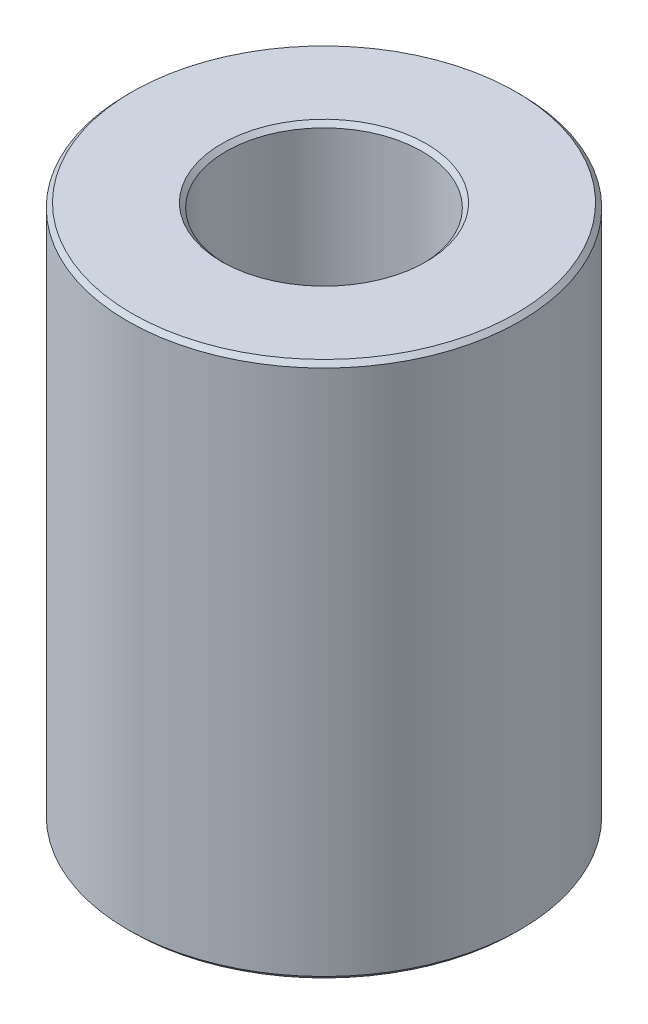
ISO-10303-21;
HEADER;
FILE_DESCRIPTION(('STEP AP214'),'2;1');
FILE_NAME('part.step','',(''),(''),'','','');
FILE_SCHEMA(('AUTOMOTIVE_DESIGN { 1 0 10303 214 1 1 1 1 }'));
ENDSEC;
DATA;
#1=APPLICATION_CONTEXT('core data for automotive mechanical design processes');
#2=APPLICATION_PROTOCOL_DEFINITION('international standard','automotive_design',2000,#1);
#3=PRODUCT_CONTEXT('',#1,'mechanical');
#4=PRODUCT('Part','Part','',(#3));
#5=PRODUCT_RELATED_PRODUCT_CATEGORY('part','',(#4));
#6=PRODUCT_DEFINITION_FORMATION('','',#4);
#7=PRODUCT_DEFINITION_CONTEXT('part definition',#1,'design');
#8=PRODUCT_DEFINITION('design','',#6,#7);
#9=PRODUCT_DEFINITION_SHAPE('','',#8);
#10=(LENGTH_UNIT() NAMED_UNIT(*) SI_UNIT(.MILLI.,.METRE.));
#11=(NAMED_UNIT(*) PLANE_ANGLE_UNIT() SI_UNIT($,.RADIAN.));
#12=(NAMED_UNIT(*) SI_UNIT($,.STERADIAN.) SOLID_ANGLE_UNIT());
#13=UNCERTAINTY_MEASURE_WITH_UNIT(LENGTH_MEASURE(1.E-05),#10,'distance_accuracy_value','');
#14=(GEOMETRIC_REPRESENTATION_CONTEXT(3) GLOBAL_UNCERTAINTY_ASSIGNED_CONTEXT((#13)) GLOBAL_UNIT_ASSIGNED_CONTEXT((#10,
#11,#12)) REPRESENTATION_CONTEXT('',''));
#15=CARTESIAN_POINT('',(0.,0.,0.));
#16=DIRECTION('',(0.,0.,1.));
#17=DIRECTION('',(1.,0.,0.));
#18=AXIS2_PLACEMENT_3D('',#15,#16,#17);
#19=CARTESIAN_POINT('',(0.,95.4662310760009,0.));
#20=DIRECTION('',(0.,-1.,0.));
#21=DIRECTION('',(0.,0.,-1.));
#22=AXIS2_PLACEMENT_3D('',#19,#20,#21);
#23=CYLINDRICAL_SURFACE('',#22,35.);
#24=CARTESIAN_POINT('',(0.,0.7812923201891,0.));
#25=DIRECTION('',(0.,1.,0.));
#26=DIRECTION('',(0.,0.,1.));
#27=AXIS2_PLACEMENT_3D('',#24,#25,#26);
#28=CIRCLE('',#27,35.);
#29=CARTESIAN_POINT('',(0.,0.7812923201891,35.));
#30=VERTEX_POINT('',#29);
#31=EDGE_CURVE('E10',#30,#30,#28,.T.);
#32=ORIENTED_EDGE('',*,*,#31,.T.);
#33=EDGE_LOOP('',(#32));
#34=FACE_BOUND('',#33,.T.);
#35=CARTESIAN_POINT('',(0.,94.6849387558118,0.));
#36=DIRECTION('',(0.,1.,0.));
#37=DIRECTION('',(0.,0.,1.));
#38=AXIS2_PLACEMENT_3D('',#35,#36,#37);
#39=CIRCLE('',#38,35.);
#40=CARTESIAN_POINT('',(0.,94.6849387558118,35.));
#41=VERTEX_POINT('',#40);
#42=EDGE_CURVE('E50',#41,#41,#39,.F.);
#43=ORIENTED_EDGE('',*,*,#42,.T.);
#44=EDGE_LOOP('',(#43));
#45=FACE_BOUND('',#44,.T.);
#46=ADVANCED_FACE('F39',(#34,#45),#23,.T.);
#47=CARTESIAN_POINT('',(0.,95.4662310760009,0.));
#48=DIRECTION('',(0.,1.,0.));
#49=DIRECTION('',(0.,0.,1.));
#50=AXIS2_PLACEMENT_3D('',#47,#48,#49);
#51=PLANE('',#50);
#52=CARTESIAN_POINT('',(0.,95.4662310760009,0.));
#53=DIRECTION('',(0.,1.,0.));
#54=DIRECTION('',(0.,0.,1.));
#55=AXIS2_PLACEMENT_3D('',#52,#53,#54);
#56=CIRCLE('',#55,18.2259943685112);
#57=CARTESIAN_POINT('',(0.,95.4662310760009,18.2259943685112));
#58=VERTEX_POINT('',#57);
#59=EDGE_CURVE('E58',#58,#58,#56,.F.);
#60=ORIENTED_EDGE('',*,*,#59,.T.);
#61=EDGE_LOOP('',(#60));
#62=FACE_BOUND('',#61,.T.);
#63=CARTESIAN_POINT('',(0.,95.4662310760009,0.));
#64=DIRECTION('',(0.,1.,0.));
#65=DIRECTION('',(0.,0.,1.));
#66=AXIS2_PLACEMENT_3D('',#63,#64,#65);
#67=CIRCLE('',#66,34.2187076798109);
#68=CARTESIAN_POINT('',(0.,95.4662310760009,34.2187076798109));
#69=VERTEX_POINT('',#68);
#70=EDGE_CURVE('E61',#69,#69,#67,.T.);
#71=ORIENTED_EDGE('',*,*,#70,.T.);
#72=EDGE_LOOP('',(#71));
#73=FACE_BOUND('',#72,.T.);
#74=ADVANCED_FACE('F88',(#62,#73),#51,.T.);
#75=CARTESIAN_POINT('',(0.,0.,0.));
#76=DIRECTION('',(0.,1.,0.));
#77=DIRECTION('',(0.,0.,1.));
#78=AXIS2_PLACEMENT_3D('',#75,#76,#77);
#79=PLANE('',#78);
#80=CARTESIAN_POINT('',(0.,0.,0.));
#81=DIRECTION('',(0.,1.,0.));
#82=DIRECTION('',(0.,0.,1.));
#83=AXIS2_PLACEMENT_3D('',#80,#81,#82);
#84=CIRCLE('',#83,18.2259943685112);
#85=CARTESIAN_POINT('',(0.,0.,18.2259943685112));
#86=VERTEX_POINT('',#85);
#87=EDGE_CURVE('E51',#86,#86,#84,.T.);
#88=ORIENTED_EDGE('',*,*,#87,.T.);
#89=EDGE_LOOP('',(#88));
#90=FACE_BOUND('',#89,.T.);
#91=CARTESIAN_POINT('',(0.,0.,0.));
#92=DIRECTION('',(0.,1.,0.));
#93=DIRECTION('',(0.,0.,1.));
#94=AXIS2_PLACEMENT_3D('',#91,#92,#93);
#95=CIRCLE('',#94,34.2187076798109);
#96=CARTESIAN_POINT('',(0.,0.,34.2187076798109));
#97=VERTEX_POINT('',#96);
#98=EDGE_CURVE('E54',#97,#97,#95,.F.);
#99=ORIENTED_EDGE('',*,*,#98,.T.);
#100=EDGE_LOOP('',(#99));
#101=FACE_BOUND('',#100,.T.);
#102=ADVANCED_FACE('F83',(#90,#101),#79,.F.);
#103=CARTESIAN_POINT('',(0.,95.4662310760009,0.));
#104=DIRECTION('',(0.,-1.,0.));
#105=DIRECTION('',(0.,0.,-1.));
#106=AXIS2_PLACEMENT_3D('',#103,#104,#105);
#107=CYLINDRICAL_SURFACE('',#106,17.4447020483221);
#108=CARTESIAN_POINT('',(0.,94.6849387558118,0.));
#109=DIRECTION('',(0.,1.,0.));
#110=DIRECTION('',(0.,0.,1.));
#111=AXIS2_PLACEMENT_3D('',#108,#109,#110);
#112=CIRCLE('',#111,17.4447020483221);
#113=CARTESIAN_POINT('',(0.,94.6849387558118,17.4447020483221));
#114=VERTEX_POINT('',#113);
#115=EDGE_CURVE('E67',#114,#114,#112,.T.);
#116=ORIENTED_EDGE('',*,*,#115,.T.);
#117=EDGE_LOOP('',(#116));
#118=FACE_BOUND('',#117,.T.);
#119=CARTESIAN_POINT('',(0.,0.781292320189086,0.));
#120=DIRECTION('',(0.,1.,0.));
#121=DIRECTION('',(0.,0.,1.));
#122=AXIS2_PLACEMENT_3D('',#119,#120,#121);
#123=CIRCLE('',#122,17.4447020483221);
#124=CARTESIAN_POINT('',(0.,0.781292320189086,17.4447020483221));
#125=VERTEX_POINT('',#124);
#126=EDGE_CURVE('E69',#125,#125,#123,.F.);
#127=ORIENTED_EDGE('',*,*,#126,.T.);
#128=EDGE_LOOP('',(#127));
#129=FACE_BOUND('',#128,.T.);
#130=ADVANCED_FACE('F71',(#118,#129),#107,.F.);
#131=CARTESIAN_POINT('',(0.,94.6849387558118,0.));
#132=DIRECTION('',(0.,1.,0.));
#133=DIRECTION('',(0.,0.,1.));
#134=AXIS2_PLACEMENT_3D('',#131,#132,#133);
#135=CONICAL_SURFACE('',#134,17.4447020483221,0.785398163397446);
#136=ORIENTED_EDGE('',*,*,#59,.F.);
#137=EDGE_LOOP('',(#136));
#138=FACE_BOUND('',#137,.T.);
#139=ORIENTED_EDGE('',*,*,#115,.F.);
#140=EDGE_LOOP('',(#139));
#141=FACE_BOUND('',#140,.T.);
#142=ADVANCED_FACE('F77',(#138,#141),#135,.F.);
#143=CARTESIAN_POINT('',(0.,0.,0.));
#144=DIRECTION('',(0.,-1.,0.));
#145=DIRECTION('',(0.,0.,-1.));
#146=AXIS2_PLACEMENT_3D('',#143,#144,#145);
#147=CONICAL_SURFACE('',#146,18.2259943685112,0.785398163397446);
#148=ORIENTED_EDGE('',*,*,#126,.F.);
#149=EDGE_LOOP('',(#148));
#150=FACE_BOUND('',#149,.T.);
#151=ORIENTED_EDGE('',*,*,#87,.F.);
#152=EDGE_LOOP('',(#151));
#153=FACE_BOUND('',#152,.T.);
#154=ADVANCED_FACE('F73',(#150,#153),#147,.F.);
#155=CARTESIAN_POINT('',(0.,0.7812923201891,0.));
#156=DIRECTION('',(0.,1.,0.));
#157=DIRECTION('',(0.,0.,1.));
#158=AXIS2_PLACEMENT_3D('',#155,#156,#157);
#159=CONICAL_SURFACE('',#158,35.,0.785398163397444);
#160=ORIENTED_EDGE('',*,*,#98,.F.);
#161=EDGE_LOOP('',(#160));
#162=FACE_BOUND('',#161,.T.);
#163=ORIENTED_EDGE('',*,*,#31,.F.);
#164=EDGE_LOOP('',(#163));
#165=FACE_BOUND('',#164,.T.);
#166=ADVANCED_FACE('F76',(#162,#165),#159,.T.);
#167=CARTESIAN_POINT('',(0.,95.4662310760009,0.));
#168=DIRECTION('',(0.,-1.,0.));
#169=DIRECTION('',(0.,0.,-1.));
#170=AXIS2_PLACEMENT_3D('',#167,#168,#169);
#171=CONICAL_SURFACE('',#170,34.2187076798109,0.785398163397453);
#172=ORIENTED_EDGE('',*,*,#42,.F.);
#173=EDGE_LOOP('',(#172));
#174=FACE_BOUND('',#173,.T.);
#175=ORIENTED_EDGE('',*,*,#70,.F.);
#176=EDGE_LOOP('',(#175));
#177=FACE_BOUND('',#176,.T.);
#178=ADVANCED_FACE('F45',(#174,#177),#171,.T.);
#179=CLOSED_SHELL('',(#46,#74,#102,#130,#142,#154,#166,#178));
#180=MANIFOLD_SOLID_BREP('B2',#179);
#181=ADVANCED_BREP_SHAPE_REPRESENTATION('',(#18,#180),#14);
#182=SHAPE_DEFINITION_REPRESENTATION(#9,#181);
ENDSEC;
END-ISO-10303-21;
